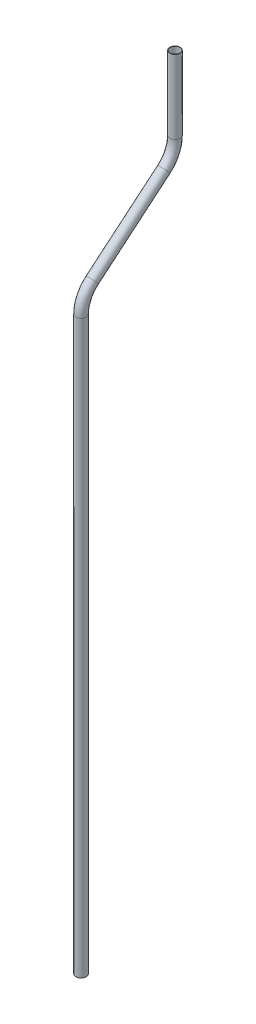
ISO-10303-21;
HEADER;
FILE_DESCRIPTION(('STEP AP214'),'2;1');
FILE_NAME('part.step','',(''),(''),'','','');
FILE_SCHEMA(('AUTOMOTIVE_DESIGN { 1 0 10303 214 1 1 1 1 }'));
ENDSEC;
DATA;
#1=APPLICATION_CONTEXT('core data for automotive mechanical design processes');
#2=APPLICATION_PROTOCOL_DEFINITION('international standard','automotive_design',2000,#1);
#3=PRODUCT_CONTEXT('',#1,'mechanical');
#4=PRODUCT('Part','Part','',(#3));
#5=PRODUCT_RELATED_PRODUCT_CATEGORY('part','',(#4));
#6=PRODUCT_DEFINITION_FORMATION('','',#4);
#7=PRODUCT_DEFINITION_CONTEXT('part definition',#1,'design');
#8=PRODUCT_DEFINITION('design','',#6,#7);
#9=PRODUCT_DEFINITION_SHAPE('','',#8);
#10=(LENGTH_UNIT() NAMED_UNIT(*) SI_UNIT(.MILLI.,.METRE.));
#11=(NAMED_UNIT(*) PLANE_ANGLE_UNIT() SI_UNIT($,.RADIAN.));
#12=(NAMED_UNIT(*) SI_UNIT($,.STERADIAN.) SOLID_ANGLE_UNIT());
#13=UNCERTAINTY_MEASURE_WITH_UNIT(LENGTH_MEASURE(1.E-05),#10,'distance_accuracy_value','');
#14=(GEOMETRIC_REPRESENTATION_CONTEXT(3) GLOBAL_UNCERTAINTY_ASSIGNED_CONTEXT((#13)) GLOBAL_UNIT_ASSIGNED_CONTEXT((#10,
#11,#12)) REPRESENTATION_CONTEXT('',''));
#15=CARTESIAN_POINT('',(0.,0.,0.));
#16=DIRECTION('',(0.,0.,1.));
#17=DIRECTION('',(1.,0.,0.));
#18=AXIS2_PLACEMENT_3D('',#15,#16,#17);
#19=CARTESIAN_POINT('',(0.,0.,0.));
#20=DIRECTION('',(0.,1.,0.));
#21=DIRECTION('',(0.,0.,1.));
#22=AXIS2_PLACEMENT_3D('',#19,#20,#21);
#23=CYLINDRICAL_SURFACE('',#22,6.35);
#24=CARTESIAN_POINT('',(0.,698.5,0.));
#25=DIRECTION('',(0.,1.,0.));
#26=DIRECTION('',(0.,0.,1.));
#27=AXIS2_PLACEMENT_3D('',#24,#25,#26);
#28=CIRCLE('',#27,6.35);
#29=CARTESIAN_POINT('',(0.,698.5,6.35000000000002));
#30=VERTEX_POINT('',#29);
#31=EDGE_CURVE('E65',#30,#30,#28,.T.);
#32=ORIENTED_EDGE('',*,*,#31,.F.);
#33=EDGE_LOOP('',(#32));
#34=FACE_BOUND('',#33,.T.);
#35=CARTESIAN_POINT('',(0.,0.,0.));
#36=DIRECTION('',(0.,1.,0.));
#37=DIRECTION('',(0.,0.,1.));
#38=AXIS2_PLACEMENT_3D('',#35,#36,#37);
#39=CIRCLE('',#38,6.35);
#40=CARTESIAN_POINT('',(0.,0.,6.35));
#41=VERTEX_POINT('',#40);
#42=EDGE_CURVE('E61',#41,#41,#39,.T.);
#43=ORIENTED_EDGE('',*,*,#42,.T.);
#44=EDGE_LOOP('',(#43));
#45=FACE_BOUND('',#44,.T.);
#46=ADVANCED_FACE('F37',(#34,#45),#23,.T.);
#47=CARTESIAN_POINT('',(0.,698.5,-38.1));
#48=DIRECTION('',(-1.,0.,0.));
#49=DIRECTION('',(0.,0.,1.));
#50=AXIS2_PLACEMENT_3D('',#47,#48,#49);
#51=TOROIDAL_SURFACE('',#50,38.1,6.35);
#52=CARTESIAN_POINT('',(0.,727.686293282833,-13.6097920709429));
#53=DIRECTION('',(0.,0.642787609686537,-0.76604444311898));
#54=DIRECTION('',(0.,0.76604444311898,0.642787609686537));
#55=AXIS2_PLACEMENT_3D('',#52,#53,#54);
#56=CIRCLE('',#55,6.35);
#57=CARTESIAN_POINT('',(0.,732.550675496639,-9.52809074943342));
#58=VERTEX_POINT('',#57);
#59=EDGE_CURVE('E69',#58,#58,#56,.T.);
#60=CARTESIAN_POINT('',(0.,698.5,-38.1));
#61=DIRECTION('',(-1.,0.,0.));
#62=DIRECTION('',(0.,0.,1.));
#63=AXIS2_PLACEMENT_3D('',#60,#61,#62);
#64=CIRCLE('',#63,44.45);
#65=EDGE_CURVE('',#30,#58,#64,.T.);
#66=ORIENTED_EDGE('',*,*,#31,.T.);
#67=ORIENTED_EDGE('',*,*,#59,.F.);
#68=ORIENTED_EDGE('',*,*,#65,.T.);
#69=ORIENTED_EDGE('',*,*,#65,.F.);
#70=EDGE_LOOP('',(#66,#68,#67,#69));
#71=FACE_BOUND('',#70,.T.);
#72=ADVANCED_FACE('F91',(#71),#51,.T.);
#73=CARTESIAN_POINT('',(0.,727.686293282833,-13.6097920709429));
#74=DIRECTION('',(0.,0.642787609686538,-0.766044443118979));
#75=DIRECTION('',(0.,0.766044443118979,0.642787609686538));
#76=AXIS2_PLACEMENT_3D('',#73,#74,#75);
#77=CYLINDRICAL_SURFACE('',#76,6.35);
#78=CARTESIAN_POINT('',(0.,801.156917070005,-101.168671919442));
#79=DIRECTION('',(0.,0.642787609686538,-0.766044443118979));
#80=DIRECTION('',(0.,0.766044443118979,0.642787609686538));
#81=AXIS2_PLACEMENT_3D('',#78,#79,#80);
#82=CIRCLE('',#81,6.35);
#83=CARTESIAN_POINT('',(0.,796.292534856199,-105.250373240952));
#84=VERTEX_POINT('',#83);
#85=EDGE_CURVE('E72',#84,#84,#82,.T.);
#86=ORIENTED_EDGE('',*,*,#85,.F.);
#87=EDGE_LOOP('',(#86));
#88=FACE_BOUND('',#87,.T.);
#89=ORIENTED_EDGE('',*,*,#59,.T.);
#90=EDGE_LOOP('',(#89));
#91=FACE_BOUND('',#90,.T.);
#92=ADVANCED_FACE('F84',(#88,#91),#77,.T.);
#93=CARTESIAN_POINT('',(0.,830.343210352838,-76.6784639903851));
#94=DIRECTION('',(1.,0.,0.));
#95=DIRECTION('',(0.,0.,-1.));
#96=AXIS2_PLACEMENT_3D('',#93,#94,#95);
#97=TOROIDAL_SURFACE('',#96,38.1000000000001,6.35);
#98=CARTESIAN_POINT('',(0.,830.343210352838,-114.778463990385));
#99=DIRECTION('',(0.,1.,0.));
#100=DIRECTION('',(0.,0.,1.));
#101=AXIS2_PLACEMENT_3D('',#98,#99,#100);
#102=CIRCLE('',#101,6.35);
#103=CARTESIAN_POINT('',(0.,830.343210352838,-121.128463990385));
#104=VERTEX_POINT('',#103);
#105=EDGE_CURVE('E41',#104,#104,#102,.T.);
#106=CARTESIAN_POINT('',(0.,830.343210352838,-76.6784639903851));
#107=DIRECTION('',(1.,0.,0.));
#108=DIRECTION('',(0.,0.,-1.));
#109=AXIS2_PLACEMENT_3D('',#106,#107,#108);
#110=CIRCLE('',#109,44.4500000000001);
#111=EDGE_CURVE('',#84,#104,#110,.T.);
#112=ORIENTED_EDGE('',*,*,#85,.T.);
#113=ORIENTED_EDGE('',*,*,#105,.F.);
#114=ORIENTED_EDGE('',*,*,#111,.T.);
#115=ORIENTED_EDGE('',*,*,#111,.F.);
#116=EDGE_LOOP('',(#112,#114,#113,#115));
#117=FACE_BOUND('',#116,.T.);
#118=ADVANCED_FACE('F82',(#117),#97,.T.);
#119=CARTESIAN_POINT('',(0.,830.343210352838,-114.778463990385));
#120=DIRECTION('',(0.,1.,0.));
#121=DIRECTION('',(0.,0.,1.));
#122=AXIS2_PLACEMENT_3D('',#119,#120,#121);
#123=CYLINDRICAL_SURFACE('',#122,6.35);
#124=CARTESIAN_POINT('',(0.,920.513210352838,-114.778463990385));
#125=DIRECTION('',(0.,1.,0.));
#126=DIRECTION('',(0.,0.,1.));
#127=AXIS2_PLACEMENT_3D('',#124,#125,#126);
#128=CIRCLE('',#127,6.35);
#129=CARTESIAN_POINT('',(0.,920.513210352838,-108.428463990385));
#130=VERTEX_POINT('',#129);
#131=EDGE_CURVE('E56',#130,#130,#128,.T.);
#132=ORIENTED_EDGE('',*,*,#131,.F.);
#133=EDGE_LOOP('',(#132));
#134=FACE_BOUND('',#133,.T.);
#135=ORIENTED_EDGE('',*,*,#105,.T.);
#136=EDGE_LOOP('',(#135));
#137=FACE_BOUND('',#136,.T.);
#138=ADVANCED_FACE('F39',(#134,#137),#123,.T.);
#139=CARTESIAN_POINT('',(0.,0.,0.));
#140=DIRECTION('',(0.,1.,0.));
#141=DIRECTION('',(0.,0.,1.));
#142=AXIS2_PLACEMENT_3D('',#139,#140,#141);
#143=PLANE('',#142);
#144=CARTESIAN_POINT('',(0.,0.,0.));
#145=DIRECTION('',(0.,1.,0.));
#146=DIRECTION('',(0.,0.,1.));
#147=AXIS2_PLACEMENT_3D('',#144,#145,#146);
#148=CIRCLE('',#147,5.969);
#149=CARTESIAN_POINT('',(0.,0.,5.969));
#150=VERTEX_POINT('',#149);
#151=EDGE_CURVE('E60',#150,#150,#148,.F.);
#152=ORIENTED_EDGE('',*,*,#151,.F.);
#153=EDGE_LOOP('',(#152));
#154=FACE_BOUND('',#153,.T.);
#155=ORIENTED_EDGE('',*,*,#42,.F.);
#156=EDGE_LOOP('',(#155));
#157=FACE_BOUND('',#156,.T.);
#158=ADVANCED_FACE('F89',(#154,#157),#143,.F.);
#159=CARTESIAN_POINT('',(0.,920.513210352838,-114.778463990385));
#160=DIRECTION('',(0.,1.,0.));
#161=DIRECTION('',(0.,0.,1.));
#162=AXIS2_PLACEMENT_3D('',#159,#160,#161);
#163=PLANE('',#162);
#164=CARTESIAN_POINT('',(0.,920.513210352838,-114.778463990385));
#165=DIRECTION('',(0.,1.,0.));
#166=DIRECTION('',(0.,0.,1.));
#167=AXIS2_PLACEMENT_3D('',#164,#165,#166);
#168=CIRCLE('',#167,5.969);
#169=CARTESIAN_POINT('',(0.,920.513210352838,-108.809463990385));
#170=VERTEX_POINT('',#169);
#171=EDGE_CURVE('E10',#170,#170,#168,.F.);
#172=ORIENTED_EDGE('',*,*,#171,.T.);
#173=EDGE_LOOP('',(#172));
#174=FACE_BOUND('',#173,.T.);
#175=ORIENTED_EDGE('',*,*,#131,.T.);
#176=EDGE_LOOP('',(#175));
#177=FACE_BOUND('',#176,.T.);
#178=ADVANCED_FACE('F108',(#174,#177),#163,.T.);
#179=CARTESIAN_POINT('',(0.,0.,0.));
#180=DIRECTION('',(0.,1.,0.));
#181=DIRECTION('',(0.,0.,1.));
#182=AXIS2_PLACEMENT_3D('',#179,#180,#181);
#183=CYLINDRICAL_SURFACE('',#182,5.969);
#184=CARTESIAN_POINT('',(0.,698.5,0.));
#185=DIRECTION('',(0.,1.,0.));
#186=DIRECTION('',(0.,0.,1.));
#187=AXIS2_PLACEMENT_3D('',#184,#185,#186);
#188=CIRCLE('',#187,5.969);
#189=CARTESIAN_POINT('',(0.,698.5,5.96900000000002));
#190=VERTEX_POINT('',#189);
#191=EDGE_CURVE('E205',#190,#190,#188,.F.);
#192=ORIENTED_EDGE('',*,*,#191,.F.);
#193=EDGE_LOOP('',(#192));
#194=FACE_BOUND('',#193,.T.);
#195=ORIENTED_EDGE('',*,*,#151,.T.);
#196=EDGE_LOOP('',(#195));
#197=FACE_BOUND('',#196,.T.);
#198=ADVANCED_FACE('F111',(#194,#197),#183,.F.);
#199=CARTESIAN_POINT('',(0.,698.5,-38.1));
#200=DIRECTION('',(-1.,0.,0.));
#201=DIRECTION('',(0.,0.,1.));
#202=AXIS2_PLACEMENT_3D('',#199,#200,#201);
#203=TOROIDAL_SURFACE('',#202,38.1,5.969);
#204=CARTESIAN_POINT('',(0.,727.686293282833,-13.6097920709429));
#205=DIRECTION('',(0.,0.642787609686537,-0.76604444311898));
#206=DIRECTION('',(0.,0.76604444311898,0.642787609686537));
#207=AXIS2_PLACEMENT_3D('',#204,#205,#206);
#208=CIRCLE('',#207,5.969);
#209=CARTESIAN_POINT('',(0.,732.25881256381,-9.772992828724));
#210=VERTEX_POINT('',#209);
#211=EDGE_CURVE('E203',#210,#210,#208,.F.);
#212=CARTESIAN_POINT('',(0.,698.5,-38.1));
#213=DIRECTION('',(-1.,0.,0.));
#214=DIRECTION('',(0.,0.,1.));
#215=AXIS2_PLACEMENT_3D('',#212,#213,#214);
#216=CIRCLE('',#215,44.069);
#217=EDGE_CURVE('',#190,#210,#216,.T.);
#218=ORIENTED_EDGE('',*,*,#191,.T.);
#219=ORIENTED_EDGE('',*,*,#211,.F.);
#220=ORIENTED_EDGE('',*,*,#217,.T.);
#221=ORIENTED_EDGE('',*,*,#217,.F.);
#222=EDGE_LOOP('',(#218,#220,#219,#221));
#223=FACE_BOUND('',#222,.T.);
#224=ADVANCED_FACE('F166',(#223),#203,.F.);
#225=CARTESIAN_POINT('',(0.,727.686293282833,-13.6097920709429));
#226=DIRECTION('',(0.,0.642787609686538,-0.766044443118979));
#227=DIRECTION('',(0.,0.766044443118979,0.642787609686538));
#228=AXIS2_PLACEMENT_3D('',#225,#226,#227);
#229=CYLINDRICAL_SURFACE('',#228,5.969);
#230=CARTESIAN_POINT('',(0.,801.156917070005,-101.168671919442));
#231=DIRECTION('',(0.,0.642787609686538,-0.766044443118979));
#232=DIRECTION('',(0.,0.766044443118979,0.642787609686538));
#233=AXIS2_PLACEMENT_3D('',#230,#231,#232);
#234=CIRCLE('',#233,5.969);
#235=CARTESIAN_POINT('',(0.,796.584397789027,-105.005471161661));
#236=VERTEX_POINT('',#235);
#237=EDGE_CURVE('E52',#236,#236,#234,.F.);
#238=ORIENTED_EDGE('',*,*,#237,.F.);
#239=EDGE_LOOP('',(#238));
#240=FACE_BOUND('',#239,.T.);
#241=ORIENTED_EDGE('',*,*,#211,.T.);
#242=EDGE_LOOP('',(#241));
#243=FACE_BOUND('',#242,.T.);
#244=ADVANCED_FACE('F102',(#240,#243),#229,.F.);
#245=CARTESIAN_POINT('',(0.,830.343210352838,-76.6784639903851));
#246=DIRECTION('',(1.,0.,0.));
#247=DIRECTION('',(0.,0.,-1.));
#248=AXIS2_PLACEMENT_3D('',#245,#246,#247);
#249=TOROIDAL_SURFACE('',#248,38.1000000000001,5.969);
#250=CARTESIAN_POINT('',(0.,830.343210352838,-114.778463990385));
#251=DIRECTION('',(0.,1.,0.));
#252=DIRECTION('',(0.,0.,1.));
#253=AXIS2_PLACEMENT_3D('',#250,#251,#252);
#254=CIRCLE('',#253,5.969);
#255=CARTESIAN_POINT('',(0.,830.343210352838,-120.747463990385));
#256=VERTEX_POINT('',#255);
#257=EDGE_CURVE('E46',#256,#256,#254,.F.);
#258=CARTESIAN_POINT('',(0.,830.343210352838,-76.6784639903851));
#259=DIRECTION('',(1.,0.,0.));
#260=DIRECTION('',(0.,0.,-1.));
#261=AXIS2_PLACEMENT_3D('',#258,#259,#260);
#262=CIRCLE('',#261,44.0690000000001);
#263=EDGE_CURVE('',#236,#256,#262,.T.);
#264=ORIENTED_EDGE('',*,*,#237,.T.);
#265=ORIENTED_EDGE('',*,*,#257,.F.);
#266=ORIENTED_EDGE('',*,*,#263,.T.);
#267=ORIENTED_EDGE('',*,*,#263,.F.);
#268=EDGE_LOOP('',(#264,#266,#265,#267));
#269=FACE_BOUND('',#268,.T.);
#270=ADVANCED_FACE('F96',(#269),#249,.F.);
#271=CARTESIAN_POINT('',(0.,830.343210352838,-114.778463990385));
#272=DIRECTION('',(0.,1.,0.));
#273=DIRECTION('',(0.,0.,1.));
#274=AXIS2_PLACEMENT_3D('',#271,#272,#273);
#275=CYLINDRICAL_SURFACE('',#274,5.969);
#276=ORIENTED_EDGE('',*,*,#171,.F.);
#277=EDGE_LOOP('',(#276));
#278=FACE_BOUND('',#277,.T.);
#279=ORIENTED_EDGE('',*,*,#257,.T.);
#280=EDGE_LOOP('',(#279));
#281=FACE_BOUND('',#280,.T.);
#282=ADVANCED_FACE('F94',(#278,#281),#275,.F.);
#283=CLOSED_SHELL('',(#46,#72,#92,#118,#138,#158,#178,#198,#224,#244,#270,#282));
#284=MANIFOLD_SOLID_BREP('B2',#283);
#285=ADVANCED_BREP_SHAPE_REPRESENTATION('',(#18,#284),#14);
#286=SHAPE_DEFINITION_REPRESENTATION(#9,#285);
ENDSEC;
END-ISO-10303-21;
